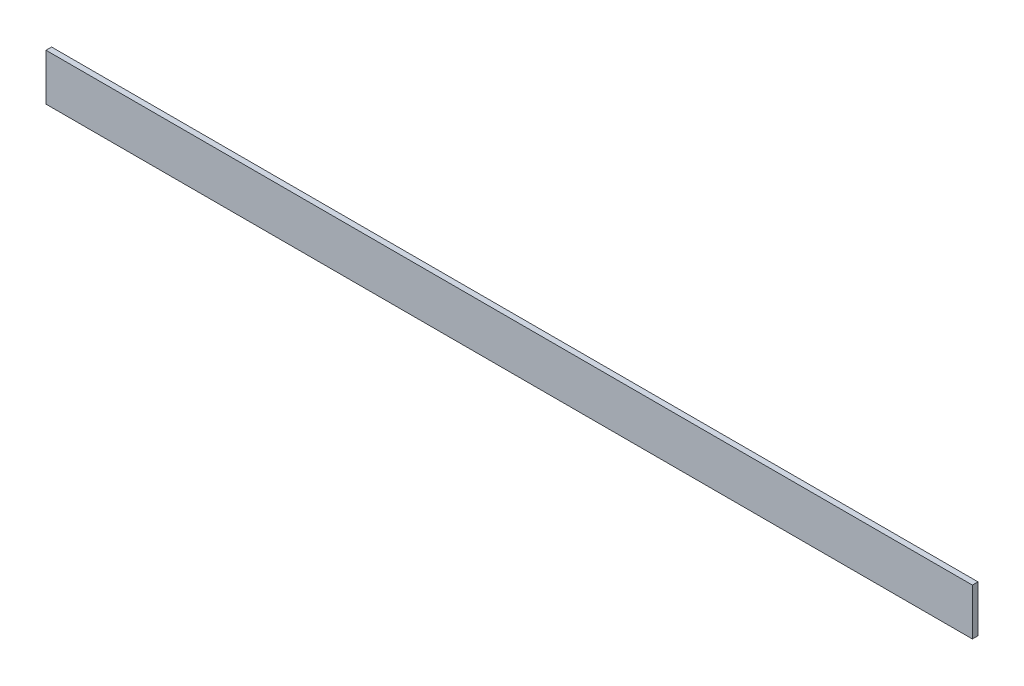
ISO-10303-21;
HEADER;
FILE_DESCRIPTION(('STEP AP214'),'2;1');
FILE_NAME('part.step','',(''),(''),'','','');
FILE_SCHEMA(('AUTOMOTIVE_DESIGN { 1 0 10303 214 1 1 1 1 }'));
ENDSEC;
DATA;
#1=APPLICATION_CONTEXT('core data for automotive mechanical design processes');
#2=APPLICATION_PROTOCOL_DEFINITION('international standard','automotive_design',2000,#1);
#3=PRODUCT_CONTEXT('',#1,'mechanical');
#4=PRODUCT('Part','Part','',(#3));
#5=PRODUCT_RELATED_PRODUCT_CATEGORY('part','',(#4));
#6=PRODUCT_DEFINITION_FORMATION('','',#4);
#7=PRODUCT_DEFINITION_CONTEXT('part definition',#1,'design');
#8=PRODUCT_DEFINITION('design','',#6,#7);
#9=PRODUCT_DEFINITION_SHAPE('','',#8);
#10=(LENGTH_UNIT() NAMED_UNIT(*) SI_UNIT(.MILLI.,.METRE.));
#11=(NAMED_UNIT(*) PLANE_ANGLE_UNIT() SI_UNIT($,.RADIAN.));
#12=(NAMED_UNIT(*) SI_UNIT($,.STERADIAN.) SOLID_ANGLE_UNIT());
#13=UNCERTAINTY_MEASURE_WITH_UNIT(LENGTH_MEASURE(1.E-05),#10,'distance_accuracy_value','');
#14=(GEOMETRIC_REPRESENTATION_CONTEXT(3) GLOBAL_UNCERTAINTY_ASSIGNED_CONTEXT((#13)) GLOBAL_UNIT_ASSIGNED_CONTEXT((#10,
#11,#12)) REPRESENTATION_CONTEXT('',''));
#15=CARTESIAN_POINT('',(0.,0.,0.));
#16=DIRECTION('',(0.,0.,1.));
#17=DIRECTION('',(1.,0.,0.));
#18=AXIS2_PLACEMENT_3D('',#15,#16,#17);
#19=CARTESIAN_POINT('',(496.,0.,-3.));
#20=DIRECTION('',(0.,0.,1.));
#21=DIRECTION('',(1.,0.,0.));
#22=AXIS2_PLACEMENT_3D('',#19,#20,#21);
#23=PLANE('',#22);
#24=DIRECTION('',(-1.,0.,0.));
#25=VECTOR('',#24,1.);
#26=CARTESIAN_POINT('',(496.,3.,-3.));
#27=LINE('',#26,#25);
#28=CARTESIAN_POINT('',(471.,3.,-3.));
#29=VERTEX_POINT('',#28);
#30=CARTESIAN_POINT('',(25.,3.,-3.00000000000006));
#31=VERTEX_POINT('',#30);
#32=EDGE_CURVE('E133',#29,#31,#27,.T.);
#33=ORIENTED_EDGE('',*,*,#32,.T.);
#34=DIRECTION('',(0.,-1.,0.));
#35=VECTOR('',#34,1.);
#36=CARTESIAN_POINT('',(25.,25.,-3.00000000000006));
#37=LINE('',#36,#35);
#38=CARTESIAN_POINT('',(25.,0.,-3.00000000000006));
#39=VERTEX_POINT('',#38);
#40=EDGE_CURVE('E117',#31,#39,#37,.T.);
#41=ORIENTED_EDGE('',*,*,#40,.T.);
#42=DIRECTION('',(-1.,0.,0.));
#43=VECTOR('',#42,1.);
#44=CARTESIAN_POINT('',(0.,0.,-3.00000000000006));
#45=LINE('',#44,#43);
#46=CARTESIAN_POINT('',(0.,0.,-3.00000000000006));
#47=VERTEX_POINT('',#46);
#48=EDGE_CURVE('E118',#39,#47,#45,.T.);
#49=ORIENTED_EDGE('',*,*,#48,.T.);
#50=DIRECTION('',(0.,1.,0.));
#51=VECTOR('',#50,1.);
#52=CARTESIAN_POINT('',(0.,0.,-3.));
#53=LINE('',#52,#51);
#54=CARTESIAN_POINT('',(0.,25.,-3.));
#55=VERTEX_POINT('',#54);
#56=EDGE_CURVE('E48',#47,#55,#53,.T.);
#57=ORIENTED_EDGE('',*,*,#56,.T.);
#58=DIRECTION('',(-1.,0.,0.));
#59=VECTOR('',#58,1.);
#60=CARTESIAN_POINT('',(496.,25.,-3.));
#61=LINE('',#60,#59);
#62=CARTESIAN_POINT('',(496.,25.,-3.));
#63=VERTEX_POINT('',#62);
#64=EDGE_CURVE('E138',#63,#55,#61,.T.);
#65=ORIENTED_EDGE('',*,*,#64,.F.);
#66=DIRECTION('',(0.,1.,0.));
#67=VECTOR('',#66,1.);
#68=CARTESIAN_POINT('',(496.,0.,-3.));
#69=LINE('',#68,#67);
#70=CARTESIAN_POINT('',(496.,0.,-3.));
#71=VERTEX_POINT('',#70);
#72=EDGE_CURVE('E78',#71,#63,#69,.T.);
#73=ORIENTED_EDGE('',*,*,#72,.F.);
#74=DIRECTION('',(-1.,0.,0.));
#75=VECTOR('',#74,1.);
#76=CARTESIAN_POINT('',(496.,0.,-3.));
#77=LINE('',#76,#75);
#78=CARTESIAN_POINT('',(471.,0.,-3.));
#79=VERTEX_POINT('',#78);
#80=EDGE_CURVE('E150',#71,#79,#77,.T.);
#81=ORIENTED_EDGE('',*,*,#80,.T.);
#82=DIRECTION('',(0.,-1.,0.));
#83=VECTOR('',#82,1.);
#84=CARTESIAN_POINT('',(471.,25.,-3.));
#85=LINE('',#84,#83);
#86=EDGE_CURVE('E147',#29,#79,#85,.T.);
#87=ORIENTED_EDGE('',*,*,#86,.F.);
#88=EDGE_LOOP('',(#33,#41,#49,#57,#65,#73,#81,#87));
#89=FACE_BOUND('',#88,.T.);
#90=ADVANCED_FACE('F34',(#89),#23,.F.);
#91=CARTESIAN_POINT('',(496.,25.,0.));
#92=DIRECTION('',(0.,1.,0.));
#93=DIRECTION('',(0.,0.,1.));
#94=AXIS2_PLACEMENT_3D('',#91,#92,#93);
#95=PLANE('',#94);
#96=DIRECTION('',(0.,0.,-1.));
#97=VECTOR('',#96,1.);
#98=CARTESIAN_POINT('',(0.,25.,0.));
#99=LINE('',#98,#97);
#100=CARTESIAN_POINT('',(0.,25.,0.));
#101=VERTEX_POINT('',#100);
#102=EDGE_CURVE('E165',#101,#55,#99,.T.);
#103=ORIENTED_EDGE('',*,*,#102,.F.);
#104=DIRECTION('',(-1.,0.,0.));
#105=VECTOR('',#104,1.);
#106=CARTESIAN_POINT('',(496.,25.,0.));
#107=LINE('',#106,#105);
#108=CARTESIAN_POINT('',(496.,25.,0.));
#109=VERTEX_POINT('',#108);
#110=EDGE_CURVE('E131',#109,#101,#107,.T.);
#111=ORIENTED_EDGE('',*,*,#110,.F.);
#112=DIRECTION('',(0.,0.,-1.));
#113=VECTOR('',#112,1.);
#114=CARTESIAN_POINT('',(496.,25.,0.));
#115=LINE('',#114,#113);
#116=EDGE_CURVE('E157',#109,#63,#115,.T.);
#117=ORIENTED_EDGE('',*,*,#116,.T.);
#118=ORIENTED_EDGE('',*,*,#64,.T.);
#119=EDGE_LOOP('',(#103,#111,#117,#118));
#120=FACE_BOUND('',#119,.T.);
#121=ADVANCED_FACE('F176',(#120),#95,.T.);
#122=CARTESIAN_POINT('',(496.,0.,0.));
#123=DIRECTION('',(0.,0.,1.));
#124=DIRECTION('',(1.,0.,0.));
#125=AXIS2_PLACEMENT_3D('',#122,#123,#124);
#126=PLANE('',#125);
#127=DIRECTION('',(0.,1.,0.));
#128=VECTOR('',#127,1.);
#129=CARTESIAN_POINT('',(0.,0.,0.));
#130=LINE('',#129,#128);
#131=CARTESIAN_POINT('',(0.,0.,0.));
#132=VERTEX_POINT('',#131);
#133=EDGE_CURVE('E167',#132,#101,#130,.T.);
#134=ORIENTED_EDGE('',*,*,#133,.F.);
#135=DIRECTION('',(-1.,0.,0.));
#136=VECTOR('',#135,1.);
#137=CARTESIAN_POINT('',(496.,0.,0.));
#138=LINE('',#137,#136);
#139=CARTESIAN_POINT('',(496.,0.,0.));
#140=VERTEX_POINT('',#139);
#141=EDGE_CURVE('E128',#140,#132,#138,.T.);
#142=ORIENTED_EDGE('',*,*,#141,.F.);
#143=DIRECTION('',(0.,1.,0.));
#144=VECTOR('',#143,1.);
#145=CARTESIAN_POINT('',(496.,0.,0.));
#146=LINE('',#145,#144);
#147=EDGE_CURVE('E160',#140,#109,#146,.T.);
#148=ORIENTED_EDGE('',*,*,#147,.T.);
#149=ORIENTED_EDGE('',*,*,#110,.T.);
#150=EDGE_LOOP('',(#134,#142,#148,#149));
#151=FACE_BOUND('',#150,.T.);
#152=ADVANCED_FACE('F173',(#151),#126,.T.);
#153=CARTESIAN_POINT('',(496.,0.,0.));
#154=DIRECTION('',(0.,-1.,0.));
#155=DIRECTION('',(0.,0.,-1.));
#156=AXIS2_PLACEMENT_3D('',#153,#154,#155);
#157=PLANE('',#156);
#158=ORIENTED_EDGE('',*,*,#48,.F.);
#159=DIRECTION('',(0.,0.,1.));
#160=VECTOR('',#159,1.);
#161=CARTESIAN_POINT('',(25.,0.,-25.0000000000001));
#162=LINE('',#161,#160);
#163=CARTESIAN_POINT('',(25.,0.,-25.0000000000001));
#164=VERTEX_POINT('',#163);
#165=EDGE_CURVE('E111',#164,#39,#162,.T.);
#166=ORIENTED_EDGE('',*,*,#165,.F.);
#167=DIRECTION('',(-1.,0.,0.));
#168=VECTOR('',#167,1.);
#169=CARTESIAN_POINT('',(496.,0.,-25.));
#170=LINE('',#169,#168);
#171=CARTESIAN_POINT('',(471.,0.,-25.));
#172=VERTEX_POINT('',#171);
#173=EDGE_CURVE('E123',#172,#164,#170,.T.);
#174=ORIENTED_EDGE('',*,*,#173,.F.);
#175=DIRECTION('',(0.,0.,-1.));
#176=VECTOR('',#175,1.);
#177=CARTESIAN_POINT('',(471.,0.,-25.));
#178=LINE('',#177,#176);
#179=EDGE_CURVE('E151',#79,#172,#178,.T.);
#180=ORIENTED_EDGE('',*,*,#179,.F.);
#181=ORIENTED_EDGE('',*,*,#80,.F.);
#182=DIRECTION('',(0.,0.,1.));
#183=VECTOR('',#182,1.);
#184=CARTESIAN_POINT('',(496.,0.,0.));
#185=LINE('',#184,#183);
#186=EDGE_CURVE('E57',#71,#140,#185,.T.);
#187=ORIENTED_EDGE('',*,*,#186,.T.);
#188=ORIENTED_EDGE('',*,*,#141,.T.);
#189=DIRECTION('',(0.,0.,1.));
#190=VECTOR('',#189,1.);
#191=CARTESIAN_POINT('',(0.,0.,0.));
#192=LINE('',#191,#190);
#193=EDGE_CURVE('E73',#47,#132,#192,.T.);
#194=ORIENTED_EDGE('',*,*,#193,.F.);
#195=EDGE_LOOP('',(#158,#166,#174,#180,#181,#187,#188,#194));
#196=FACE_BOUND('',#195,.T.);
#197=ADVANCED_FACE('F121',(#196),#157,.T.);
#198=CARTESIAN_POINT('',(496.,3.,-25.));
#199=DIRECTION('',(0.,0.,-1.));
#200=DIRECTION('',(-1.,0.,0.));
#201=AXIS2_PLACEMENT_3D('',#198,#199,#200);
#202=PLANE('',#201);
#203=DIRECTION('',(0.,-1.,0.));
#204=VECTOR('',#203,1.);
#205=CARTESIAN_POINT('',(25.,25.,-25.0000000000001));
#206=LINE('',#205,#204);
#207=CARTESIAN_POINT('',(25.,3.,-25.0000000000001));
#208=VERTEX_POINT('',#207);
#209=EDGE_CURVE('E108',#208,#164,#206,.T.);
#210=ORIENTED_EDGE('',*,*,#209,.F.);
#211=DIRECTION('',(-1.,0.,0.));
#212=VECTOR('',#211,1.);
#213=CARTESIAN_POINT('',(496.,3.,-25.));
#214=LINE('',#213,#212);
#215=CARTESIAN_POINT('',(471.,3.,-25.));
#216=VERTEX_POINT('',#215);
#217=EDGE_CURVE('E129',#216,#208,#214,.T.);
#218=ORIENTED_EDGE('',*,*,#217,.F.);
#219=DIRECTION('',(0.,-1.,0.));
#220=VECTOR('',#219,1.);
#221=CARTESIAN_POINT('',(471.,25.,-25.));
#222=LINE('',#221,#220);
#223=EDGE_CURVE('E127',#216,#172,#222,.T.);
#224=ORIENTED_EDGE('',*,*,#223,.T.);
#225=ORIENTED_EDGE('',*,*,#173,.T.);
#226=EDGE_LOOP('',(#210,#218,#224,#225));
#227=FACE_BOUND('',#226,.T.);
#228=ADVANCED_FACE('F126',(#227),#202,.T.);
#229=CARTESIAN_POINT('',(496.,3.,0.));
#230=DIRECTION('',(0.,-1.,0.));
#231=DIRECTION('',(0.,0.,-1.));
#232=AXIS2_PLACEMENT_3D('',#229,#230,#231);
#233=PLANE('',#232);
#234=ORIENTED_EDGE('',*,*,#217,.T.);
#235=DIRECTION('',(0.,0.,1.));
#236=VECTOR('',#235,1.);
#237=CARTESIAN_POINT('',(25.,3.,0.));
#238=LINE('',#237,#236);
#239=EDGE_CURVE('E11',#208,#31,#238,.T.);
#240=ORIENTED_EDGE('',*,*,#239,.T.);
#241=ORIENTED_EDGE('',*,*,#32,.F.);
#242=DIRECTION('',(0.,0.,-1.));
#243=VECTOR('',#242,1.);
#244=CARTESIAN_POINT('',(471.,3.,0.));
#245=LINE('',#244,#243);
#246=EDGE_CURVE('E41',#29,#216,#245,.T.);
#247=ORIENTED_EDGE('',*,*,#246,.T.);
#248=EDGE_LOOP('',(#234,#240,#241,#247));
#249=FACE_BOUND('',#248,.T.);
#250=ADVANCED_FACE('F142',(#249),#233,.F.);
#251=CARTESIAN_POINT('',(496.,0.,0.));
#252=DIRECTION('',(-1.,0.,0.));
#253=DIRECTION('',(0.,0.,1.));
#254=AXIS2_PLACEMENT_3D('',#251,#252,#253);
#255=PLANE('',#254);
#256=ORIENTED_EDGE('',*,*,#186,.F.);
#257=ORIENTED_EDGE('',*,*,#72,.T.);
#258=ORIENTED_EDGE('',*,*,#116,.F.);
#259=ORIENTED_EDGE('',*,*,#147,.F.);
#260=EDGE_LOOP('',(#256,#257,#258,#259));
#261=FACE_BOUND('',#260,.T.);
#262=ADVANCED_FACE('F180',(#261),#255,.F.);
#263=CARTESIAN_POINT('',(0.,0.,0.));
#264=DIRECTION('',(-1.,0.,0.));
#265=DIRECTION('',(0.,0.,1.));
#266=AXIS2_PLACEMENT_3D('',#263,#264,#265);
#267=PLANE('',#266);
#268=ORIENTED_EDGE('',*,*,#56,.F.);
#269=ORIENTED_EDGE('',*,*,#193,.T.);
#270=ORIENTED_EDGE('',*,*,#133,.T.);
#271=ORIENTED_EDGE('',*,*,#102,.T.);
#272=EDGE_LOOP('',(#268,#269,#270,#271));
#273=FACE_BOUND('',#272,.T.);
#274=ADVANCED_FACE('F170',(#273),#267,.T.);
#275=CARTESIAN_POINT('',(471.,25.,-25.));
#276=DIRECTION('',(-1.,0.,0.));
#277=DIRECTION('',(0.,0.,1.));
#278=AXIS2_PLACEMENT_3D('',#275,#276,#277);
#279=PLANE('',#278);
#280=ORIENTED_EDGE('',*,*,#86,.T.);
#281=ORIENTED_EDGE('',*,*,#179,.T.);
#282=ORIENTED_EDGE('',*,*,#223,.F.);
#283=ORIENTED_EDGE('',*,*,#246,.F.);
#284=EDGE_LOOP('',(#280,#281,#282,#283));
#285=FACE_BOUND('',#284,.T.);
#286=ADVANCED_FACE('F146',(#285),#279,.F.);
#287=CARTESIAN_POINT('',(25.,25.,-25.0000000000001));
#288=DIRECTION('',(1.,0.,0.));
#289=DIRECTION('',(0.,0.,-1.));
#290=AXIS2_PLACEMENT_3D('',#287,#288,#289);
#291=PLANE('',#290);
#292=ORIENTED_EDGE('',*,*,#209,.T.);
#293=ORIENTED_EDGE('',*,*,#165,.T.);
#294=ORIENTED_EDGE('',*,*,#40,.F.);
#295=ORIENTED_EDGE('',*,*,#239,.F.);
#296=EDGE_LOOP('',(#292,#293,#294,#295));
#297=FACE_BOUND('',#296,.T.);
#298=ADVANCED_FACE('F110',(#297),#291,.F.);
#299=CLOSED_SHELL('',(#90,#121,#152,#197,#228,#250,#262,#274,#286,#298));
#300=MANIFOLD_SOLID_BREP('B2',#299);
#301=ADVANCED_BREP_SHAPE_REPRESENTATION('',(#18,#300),#14);
#302=SHAPE_DEFINITION_REPRESENTATION(#9,#301);
ENDSEC;
END-ISO-10303-21;
